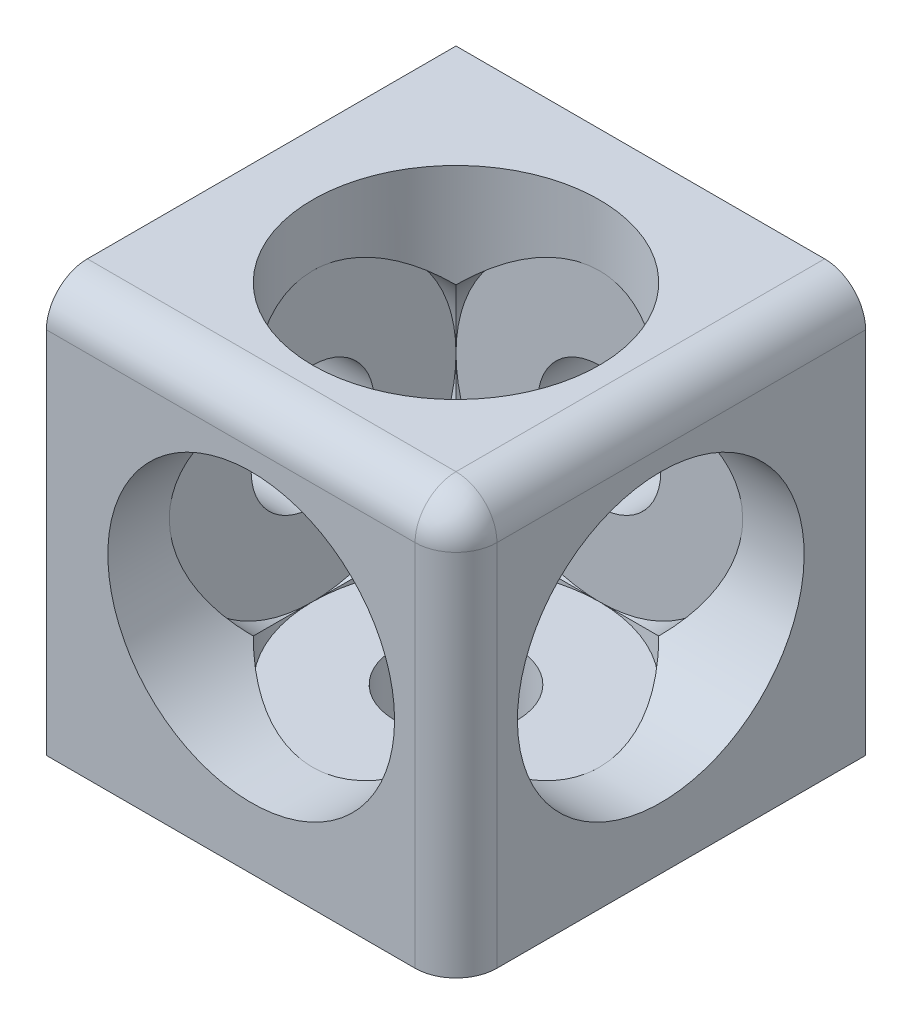
ISO-10303-21;
HEADER;
FILE_DESCRIPTION(('STEP AP214'),'2;1');
FILE_NAME('part.step','',(''),(''),'','','');
FILE_SCHEMA(('AUTOMOTIVE_DESIGN { 1 0 10303 214 1 1 1 1 }'));
ENDSEC;
DATA;
#1=APPLICATION_CONTEXT('core data for automotive mechanical design processes');
#2=APPLICATION_PROTOCOL_DEFINITION('international standard','automotive_design',2000,#1);
#3=PRODUCT_CONTEXT('',#1,'mechanical');
#4=PRODUCT('Part','Part','',(#3));
#5=PRODUCT_RELATED_PRODUCT_CATEGORY('part','',(#4));
#6=PRODUCT_DEFINITION_FORMATION('','',#4);
#7=PRODUCT_DEFINITION_CONTEXT('part definition',#1,'design');
#8=PRODUCT_DEFINITION('design','',#6,#7);
#9=PRODUCT_DEFINITION_SHAPE('','',#8);
#10=(LENGTH_UNIT() NAMED_UNIT(*) SI_UNIT(.MILLI.,.METRE.));
#11=(NAMED_UNIT(*) PLANE_ANGLE_UNIT() SI_UNIT($,.RADIAN.));
#12=(NAMED_UNIT(*) SI_UNIT($,.STERADIAN.) SOLID_ANGLE_UNIT());
#13=UNCERTAINTY_MEASURE_WITH_UNIT(LENGTH_MEASURE(1.E-05),#10,'distance_accuracy_value','');
#14=(GEOMETRIC_REPRESENTATION_CONTEXT(3) GLOBAL_UNCERTAINTY_ASSIGNED_CONTEXT((#13)) GLOBAL_UNIT_ASSIGNED_CONTEXT((#10,
#11,#12)) REPRESENTATION_CONTEXT('',''));
#15=CARTESIAN_POINT('',(0.,0.,0.));
#16=DIRECTION('',(0.,0.,1.));
#17=DIRECTION('',(1.,0.,0.));
#18=AXIS2_PLACEMENT_3D('',#15,#16,#17);
#19=CARTESIAN_POINT('',(-10.,10.,3.));
#20=DIRECTION('',(0.,0.,1.));
#21=DIRECTION('',(1.,0.,0.));
#22=AXIS2_PLACEMENT_3D('',#19,#20,#21);
#23=CYLINDRICAL_SURFACE('',#22,7.);
#24=CARTESIAN_POINT('',(-10.,10.,3.));
#25=DIRECTION('',(0.,0.,1.));
#26=DIRECTION('',(1.,0.,0.));
#27=AXIS2_PLACEMENT_3D('',#24,#25,#26);
#28=CIRCLE('',#27,7.);
#29=CARTESIAN_POINT('',(-10.,3.,3.));
#30=VERTEX_POINT('',#29);
#31=CARTESIAN_POINT('',(-3.,10.,3.));
#32=VERTEX_POINT('',#31);
#33=EDGE_CURVE('E202',#30,#32,#28,.T.);
#34=ORIENTED_EDGE('',*,*,#33,.F.);
#35=CARTESIAN_POINT('',(-10.,10.,10.));
#36=DIRECTION('',(0.,-0.707106781186547,0.707106781186547));
#37=DIRECTION('',(0.,0.707106781186547,0.707106781186547));
#38=AXIS2_PLACEMENT_3D('',#35,#36,#37);
#39=ELLIPSE('',#38,9.89949493661167,7.);
#40=CARTESIAN_POINT('',(-5.05025253169417,5.05025253169417,5.05025253169417));
#41=VERTEX_POINT('',#40);
#42=EDGE_CURVE('E193',#30,#41,#39,.T.);
#43=ORIENTED_EDGE('',*,*,#42,.T.);
#44=CARTESIAN_POINT('',(-10.,10.,10.));
#45=DIRECTION('',(0.707106781186547,0.,0.707106781186547));
#46=DIRECTION('',(-0.707106781186547,0.,0.707106781186547));
#47=AXIS2_PLACEMENT_3D('',#44,#45,#46);
#48=ELLIPSE('',#47,9.89949493661167,7.);
#49=EDGE_CURVE('E42',#41,#32,#48,.T.);
#50=ORIENTED_EDGE('',*,*,#49,.T.);
#51=EDGE_LOOP('',(#34,#43,#50));
#52=FACE_BOUND('',#51,.T.);
#53=ADVANCED_FACE('F33',(#52),#23,.F.);
#54=CARTESIAN_POINT('',(-5.05025253169417,14.9497474683058,5.05025253169417));
#55=VERTEX_POINT('',#54);
#56=EDGE_CURVE('E37',#32,#55,#48,.T.);
#57=ORIENTED_EDGE('',*,*,#56,.T.);
#58=CARTESIAN_POINT('',(-10.,10.,10.));
#59=DIRECTION('',(0.,0.707106781186547,0.707106781186547));
#60=DIRECTION('',(0.,-0.707106781186547,0.707106781186547));
#61=AXIS2_PLACEMENT_3D('',#58,#59,#60);
#62=ELLIPSE('',#61,9.89949493661167,7.);
#63=CARTESIAN_POINT('',(-10.,17.,3.));
#64=VERTEX_POINT('',#63);
#65=EDGE_CURVE('E294',#55,#64,#62,.T.);
#66=ORIENTED_EDGE('',*,*,#65,.T.);
#67=EDGE_CURVE('E197',#32,#64,#28,.T.);
#68=ORIENTED_EDGE('',*,*,#67,.F.);
#69=EDGE_LOOP('',(#57,#66,#68));
#70=FACE_BOUND('',#69,.T.);
#71=ADVANCED_FACE('F293',(#70),#23,.F.);
#72=CARTESIAN_POINT('',(-10.,0.,10.));
#73=DIRECTION('',(0.,1.,0.));
#74=DIRECTION('',(0.,0.,1.));
#75=AXIS2_PLACEMENT_3D('',#72,#73,#74);
#76=CYLINDRICAL_SURFACE('',#75,3.);
#77=CARTESIAN_POINT('',(-10.,0.,10.));
#78=DIRECTION('',(0.,1.,0.));
#79=DIRECTION('',(0.,0.,1.));
#80=AXIS2_PLACEMENT_3D('',#77,#78,#79);
#81=CIRCLE('',#80,3.);
#82=CARTESIAN_POINT('',(-10.,0.,13.));
#83=VERTEX_POINT('',#82);
#84=EDGE_CURVE('E206',#83,#83,#81,.T.);
#85=ORIENTED_EDGE('',*,*,#84,.F.);
#86=EDGE_LOOP('',(#85));
#87=FACE_BOUND('',#86,.T.);
#88=CARTESIAN_POINT('',(-10.,3.,10.));
#89=DIRECTION('',(0.,1.,0.));
#90=DIRECTION('',(0.,0.,1.));
#91=AXIS2_PLACEMENT_3D('',#88,#89,#90);
#92=CIRCLE('',#91,3.);
#93=CARTESIAN_POINT('',(-10.,3.,13.));
#94=VERTEX_POINT('',#93);
#95=EDGE_CURVE('E171',#94,#94,#92,.F.);
#96=ORIENTED_EDGE('',*,*,#95,.F.);
#97=EDGE_LOOP('',(#96));
#98=FACE_BOUND('',#97,.T.);
#99=ADVANCED_FACE('F343',(#87,#98),#76,.F.);
#100=CARTESIAN_POINT('',(-17.,10.,10.));
#101=DIRECTION('',(1.,0.,0.));
#102=DIRECTION('',(0.,1.,0.));
#103=AXIS2_PLACEMENT_3D('',#100,#101,#102);
#104=CYLINDRICAL_SURFACE('',#103,7.);
#105=CARTESIAN_POINT('',(-17.,10.,10.));
#106=DIRECTION('',(1.,0.,0.));
#107=DIRECTION('',(0.,1.,0.));
#108=AXIS2_PLACEMENT_3D('',#105,#106,#107);
#109=CIRCLE('',#108,7.);
#110=CARTESIAN_POINT('',(-17.,3.,10.));
#111=VERTEX_POINT('',#110);
#112=CARTESIAN_POINT('',(-17.,10.,3.));
#113=VERTEX_POINT('',#112);
#114=EDGE_CURVE('E187',#111,#113,#109,.T.);
#115=ORIENTED_EDGE('',*,*,#114,.F.);
#116=CARTESIAN_POINT('',(-10.,10.,10.));
#117=DIRECTION('',(0.707106781186547,-0.707106781186547,0.));
#118=DIRECTION('',(0.707106781186547,0.707106781186547,0.));
#119=AXIS2_PLACEMENT_3D('',#116,#117,#118);
#120=ELLIPSE('',#119,9.89949493661167,7.);
#121=CARTESIAN_POINT('',(-14.9497474683058,5.05025253169417,5.05025253169417));
#122=VERTEX_POINT('',#121);
#123=EDGE_CURVE('E302',#111,#122,#120,.T.);
#124=ORIENTED_EDGE('',*,*,#123,.T.);
#125=CARTESIAN_POINT('',(-10.,10.,10.));
#126=DIRECTION('',(-0.707106781186547,0.,0.707106781186547));
#127=DIRECTION('',(0.707106781186547,0.,0.707106781186547));
#128=AXIS2_PLACEMENT_3D('',#125,#126,#127);
#129=ELLIPSE('',#128,9.89949493661167,7.);
#130=EDGE_CURVE('E260',#113,#122,#129,.T.);
#131=ORIENTED_EDGE('',*,*,#130,.F.);
#132=EDGE_LOOP('',(#115,#124,#131));
#133=FACE_BOUND('',#132,.T.);
#134=ADVANCED_FACE('F321',(#133),#104,.F.);
#135=CARTESIAN_POINT('',(-14.9497474683058,14.9497474683058,5.05025253169417));
#136=VERTEX_POINT('',#135);
#137=EDGE_CURVE('E270',#136,#113,#129,.T.);
#138=ORIENTED_EDGE('',*,*,#137,.F.);
#139=CARTESIAN_POINT('',(-10.,10.,10.));
#140=DIRECTION('',(0.707106781186547,0.707106781186547,0.));
#141=DIRECTION('',(0.707106781186547,-0.707106781186547,0.));
#142=AXIS2_PLACEMENT_3D('',#139,#140,#141);
#143=ELLIPSE('',#142,9.89949493661167,7.);
#144=CARTESIAN_POINT('',(-17.,17.,10.));
#145=VERTEX_POINT('',#144);
#146=EDGE_CURVE('E301',#136,#145,#143,.T.);
#147=ORIENTED_EDGE('',*,*,#146,.T.);
#148=EDGE_CURVE('E188',#113,#145,#109,.T.);
#149=ORIENTED_EDGE('',*,*,#148,.F.);
#150=EDGE_LOOP('',(#138,#147,#149));
#151=FACE_BOUND('',#150,.T.);
#152=ADVANCED_FACE('F333',(#151),#104,.F.);
#153=CARTESIAN_POINT('',(-20.,10.,10.));
#154=DIRECTION('',(1.,0.,0.));
#155=DIRECTION('',(0.,1.,0.));
#156=AXIS2_PLACEMENT_3D('',#153,#154,#155);
#157=CYLINDRICAL_SURFACE('',#156,3.);
#158=CARTESIAN_POINT('',(-20.,10.,10.));
#159=DIRECTION('',(1.,0.,0.));
#160=DIRECTION('',(0.,1.,0.));
#161=AXIS2_PLACEMENT_3D('',#158,#159,#160);
#162=CIRCLE('',#161,3.);
#163=CARTESIAN_POINT('',(-20.,13.,10.));
#164=VERTEX_POINT('',#163);
#165=EDGE_CURVE('E209',#164,#164,#162,.T.);
#166=ORIENTED_EDGE('',*,*,#165,.F.);
#167=EDGE_LOOP('',(#166));
#168=FACE_BOUND('',#167,.T.);
#169=CARTESIAN_POINT('',(-17.,10.,10.));
#170=DIRECTION('',(1.,0.,0.));
#171=DIRECTION('',(0.,1.,0.));
#172=AXIS2_PLACEMENT_3D('',#169,#170,#171);
#173=CIRCLE('',#172,3.);
#174=CARTESIAN_POINT('',(-17.,13.,10.));
#175=VERTEX_POINT('',#174);
#176=EDGE_CURVE('E186',#175,#175,#173,.F.);
#177=ORIENTED_EDGE('',*,*,#176,.F.);
#178=EDGE_LOOP('',(#177));
#179=FACE_BOUND('',#178,.T.);
#180=ADVANCED_FACE('F335',(#168,#179),#157,.F.);
#181=ORIENTED_EDGE('',*,*,#130,.T.);
#182=EDGE_CURVE('E51',#122,#30,#39,.T.);
#183=ORIENTED_EDGE('',*,*,#182,.T.);
#184=EDGE_CURVE('E203',#113,#30,#28,.T.);
#185=ORIENTED_EDGE('',*,*,#184,.F.);
#186=EDGE_LOOP('',(#181,#183,#185));
#187=FACE_BOUND('',#186,.T.);
#188=ADVANCED_FACE('F299',(#187),#23,.F.);
#189=EDGE_CURVE('E201',#64,#113,#28,.T.);
#190=ORIENTED_EDGE('',*,*,#189,.F.);
#191=EDGE_CURVE('E304',#64,#136,#62,.T.);
#192=ORIENTED_EDGE('',*,*,#191,.T.);
#193=ORIENTED_EDGE('',*,*,#137,.T.);
#194=EDGE_LOOP('',(#190,#192,#193));
#195=FACE_BOUND('',#194,.T.);
#196=ADVANCED_FACE('F354',(#195),#23,.F.);
#197=CARTESIAN_POINT('',(-10.,10.,0.));
#198=DIRECTION('',(0.,0.,1.));
#199=DIRECTION('',(1.,0.,0.));
#200=AXIS2_PLACEMENT_3D('',#197,#198,#199);
#201=CYLINDRICAL_SURFACE('',#200,3.);
#202=CARTESIAN_POINT('',(-10.,10.,0.));
#203=DIRECTION('',(0.,0.,1.));
#204=DIRECTION('',(1.,0.,0.));
#205=AXIS2_PLACEMENT_3D('',#202,#203,#204);
#206=CIRCLE('',#205,3.);
#207=CARTESIAN_POINT('',(-7.,10.,0.));
#208=VERTEX_POINT('',#207);
#209=EDGE_CURVE('E212',#208,#208,#206,.T.);
#210=ORIENTED_EDGE('',*,*,#209,.F.);
#211=EDGE_LOOP('',(#210));
#212=FACE_BOUND('',#211,.T.);
#213=CARTESIAN_POINT('',(-10.,10.,3.));
#214=DIRECTION('',(0.,0.,1.));
#215=DIRECTION('',(1.,0.,0.));
#216=AXIS2_PLACEMENT_3D('',#213,#214,#215);
#217=CIRCLE('',#216,3.);
#218=CARTESIAN_POINT('',(-7.,10.,3.));
#219=VERTEX_POINT('',#218);
#220=EDGE_CURVE('E200',#219,#219,#217,.F.);
#221=ORIENTED_EDGE('',*,*,#220,.F.);
#222=EDGE_LOOP('',(#221));
#223=FACE_BOUND('',#222,.T.);
#224=ADVANCED_FACE('F363',(#212,#223),#201,.F.);
#225=CARTESIAN_POINT('',(-20.,20.,20.));
#226=DIRECTION('',(1.,0.,0.));
#227=DIRECTION('',(0.,0.,-1.));
#228=AXIS2_PLACEMENT_3D('',#225,#226,#227);
#229=PLANE('',#228);
#230=ORIENTED_EDGE('',*,*,#165,.T.);
#231=EDGE_LOOP('',(#230));
#232=FACE_BOUND('',#231,.T.);
#233=DIRECTION('',(0.,-1.,0.));
#234=VECTOR('',#233,1.);
#235=CARTESIAN_POINT('',(-20.,20.,20.));
#236=LINE('',#235,#234);
#237=CARTESIAN_POINT('',(-20.,18.,20.));
#238=VERTEX_POINT('',#237);
#239=CARTESIAN_POINT('',(-20.,0.,20.));
#240=VERTEX_POINT('',#239);
#241=EDGE_CURVE('E216',#238,#240,#236,.T.);
#242=ORIENTED_EDGE('',*,*,#241,.F.);
#243=CARTESIAN_POINT('',(-20.,18.,18.));
#244=DIRECTION('',(1.,0.,0.));
#245=DIRECTION('',(0.,0.,-1.));
#246=AXIS2_PLACEMENT_3D('',#243,#244,#245);
#247=CIRCLE('',#246,2.);
#248=CARTESIAN_POINT('',(-20.,20.,18.));
#249=VERTEX_POINT('',#248);
#250=EDGE_CURVE('E252',#238,#249,#247,.F.);
#251=ORIENTED_EDGE('',*,*,#250,.T.);
#252=DIRECTION('',(0.,0.,-1.));
#253=VECTOR('',#252,1.);
#254=CARTESIAN_POINT('',(-20.,20.,20.));
#255=LINE('',#254,#253);
#256=CARTESIAN_POINT('',(-20.,20.,0.));
#257=VERTEX_POINT('',#256);
#258=EDGE_CURVE('E222',#249,#257,#255,.T.);
#259=ORIENTED_EDGE('',*,*,#258,.T.);
#260=DIRECTION('',(0.,-1.,0.));
#261=VECTOR('',#260,1.);
#262=CARTESIAN_POINT('',(-20.,20.,0.));
#263=LINE('',#262,#261);
#264=CARTESIAN_POINT('',(-20.,0.,0.));
#265=VERTEX_POINT('',#264);
#266=EDGE_CURVE('E223',#257,#265,#263,.T.);
#267=ORIENTED_EDGE('',*,*,#266,.T.);
#268=DIRECTION('',(0.,0.,-1.));
#269=VECTOR('',#268,1.);
#270=CARTESIAN_POINT('',(-20.,0.,20.));
#271=LINE('',#270,#269);
#272=EDGE_CURVE('E238',#240,#265,#271,.T.);
#273=ORIENTED_EDGE('',*,*,#272,.F.);
#274=EDGE_LOOP('',(#242,#251,#259,#267,#273));
#275=FACE_BOUND('',#274,.T.);
#276=ADVANCED_FACE('F368',(#232,#275),#229,.F.);
#277=CARTESIAN_POINT('',(-20.,0.,20.));
#278=DIRECTION('',(0.,1.,0.));
#279=DIRECTION('',(0.,0.,1.));
#280=AXIS2_PLACEMENT_3D('',#277,#278,#279);
#281=PLANE('',#280);
#282=ORIENTED_EDGE('',*,*,#84,.T.);
#283=EDGE_LOOP('',(#282));
#284=FACE_BOUND('',#283,.T.);
#285=DIRECTION('',(0.,0.,-1.));
#286=VECTOR('',#285,1.);
#287=CARTESIAN_POINT('',(0.,0.,20.));
#288=LINE('',#287,#286);
#289=CARTESIAN_POINT('',(0.,0.,18.));
#290=VERTEX_POINT('',#289);
#291=CARTESIAN_POINT('',(0.,0.,0.));
#292=VERTEX_POINT('',#291);
#293=EDGE_CURVE('E236',#290,#292,#288,.T.);
#294=ORIENTED_EDGE('',*,*,#293,.F.);
#295=CARTESIAN_POINT('',(-2.,0.,18.));
#296=DIRECTION('',(0.,1.,0.));
#297=DIRECTION('',(0.,0.,1.));
#298=AXIS2_PLACEMENT_3D('',#295,#296,#297);
#299=CIRCLE('',#298,2.);
#300=CARTESIAN_POINT('',(-2.,0.,20.));
#301=VERTEX_POINT('',#300);
#302=EDGE_CURVE('E250',#290,#301,#299,.F.);
#303=ORIENTED_EDGE('',*,*,#302,.T.);
#304=DIRECTION('',(1.,0.,0.));
#305=VECTOR('',#304,1.);
#306=CARTESIAN_POINT('',(-20.,0.,20.));
#307=LINE('',#306,#305);
#308=EDGE_CURVE('E218',#240,#301,#307,.T.);
#309=ORIENTED_EDGE('',*,*,#308,.F.);
#310=ORIENTED_EDGE('',*,*,#272,.T.);
#311=DIRECTION('',(1.,0.,0.));
#312=VECTOR('',#311,1.);
#313=CARTESIAN_POINT('',(-20.,0.,0.));
#314=LINE('',#313,#312);
#315=EDGE_CURVE('E226',#265,#292,#314,.T.);
#316=ORIENTED_EDGE('',*,*,#315,.T.);
#317=EDGE_LOOP('',(#294,#303,#309,#310,#316));
#318=FACE_BOUND('',#317,.T.);
#319=ADVANCED_FACE('F419',(#284,#318),#281,.F.);
#320=CARTESIAN_POINT('',(0.,20.,20.));
#321=DIRECTION('',(-1.,0.,0.));
#322=DIRECTION('',(0.,-1.,0.));
#323=AXIS2_PLACEMENT_3D('',#320,#321,#322);
#324=PLANE('',#323);
#325=CARTESIAN_POINT('',(0.,10.,10.));
#326=DIRECTION('',(1.,0.,0.));
#327=DIRECTION('',(0.,1.,0.));
#328=AXIS2_PLACEMENT_3D('',#325,#326,#327);
#329=CIRCLE('',#328,7.);
#330=CARTESIAN_POINT('',(0.,17.,10.));
#331=VERTEX_POINT('',#330);
#332=EDGE_CURVE('E189',#331,#331,#329,.T.);
#333=ORIENTED_EDGE('',*,*,#332,.F.);
#334=EDGE_LOOP('',(#333));
#335=FACE_BOUND('',#334,.T.);
#336=DIRECTION('',(0.,0.,-1.));
#337=VECTOR('',#336,1.);
#338=CARTESIAN_POINT('',(0.,18.,20.));
#339=LINE('',#338,#337);
#340=CARTESIAN_POINT('',(0.,18.,0.));
#341=VERTEX_POINT('',#340);
#342=CARTESIAN_POINT('',(0.,18.,18.));
#343=VERTEX_POINT('',#342);
#344=EDGE_CURVE('E246',#341,#343,#339,.F.);
#345=ORIENTED_EDGE('',*,*,#344,.T.);
#346=DIRECTION('',(0.,1.,0.));
#347=VECTOR('',#346,1.);
#348=CARTESIAN_POINT('',(0.,0.,18.));
#349=LINE('',#348,#347);
#350=EDGE_CURVE('E248',#343,#290,#349,.F.);
#351=ORIENTED_EDGE('',*,*,#350,.T.);
#352=ORIENTED_EDGE('',*,*,#293,.T.);
#353=DIRECTION('',(0.,1.,0.));
#354=VECTOR('',#353,1.);
#355=CARTESIAN_POINT('',(0.,20.,0.));
#356=LINE('',#355,#354);
#357=EDGE_CURVE('E230',#292,#341,#356,.T.);
#358=ORIENTED_EDGE('',*,*,#357,.T.);
#359=EDGE_LOOP('',(#345,#351,#352,#358));
#360=FACE_BOUND('',#359,.T.);
#361=ADVANCED_FACE('F413',(#335,#360),#324,.F.);
#362=CARTESIAN_POINT('',(-20.,20.,20.));
#363=DIRECTION('',(0.,-1.,0.));
#364=DIRECTION('',(0.,0.,-1.));
#365=AXIS2_PLACEMENT_3D('',#362,#363,#364);
#366=PLANE('',#365);
#367=CARTESIAN_POINT('',(-10.,20.,10.));
#368=DIRECTION('',(0.,1.,0.));
#369=DIRECTION('',(0.,0.,1.));
#370=AXIS2_PLACEMENT_3D('',#367,#368,#369);
#371=CIRCLE('',#370,7.);
#372=CARTESIAN_POINT('',(-10.,20.,17.));
#373=VERTEX_POINT('',#372);
#374=EDGE_CURVE('E164',#373,#373,#371,.T.);
#375=ORIENTED_EDGE('',*,*,#374,.F.);
#376=EDGE_LOOP('',(#375));
#377=FACE_BOUND('',#376,.T.);
#378=ORIENTED_EDGE('',*,*,#258,.F.);
#379=DIRECTION('',(-1.,0.,0.));
#380=VECTOR('',#379,1.);
#381=CARTESIAN_POINT('',(0.,20.,18.));
#382=LINE('',#381,#380);
#383=CARTESIAN_POINT('',(-2.,20.,18.));
#384=VERTEX_POINT('',#383);
#385=EDGE_CURVE('E256',#249,#384,#382,.F.);
#386=ORIENTED_EDGE('',*,*,#385,.T.);
#387=DIRECTION('',(0.,0.,-1.));
#388=VECTOR('',#387,1.);
#389=CARTESIAN_POINT('',(-2.,20.,20.));
#390=LINE('',#389,#388);
#391=CARTESIAN_POINT('',(-2.,20.,0.));
#392=VERTEX_POINT('',#391);
#393=EDGE_CURVE('E254',#384,#392,#390,.T.);
#394=ORIENTED_EDGE('',*,*,#393,.T.);
#395=DIRECTION('',(-1.,0.,0.));
#396=VECTOR('',#395,1.);
#397=CARTESIAN_POINT('',(-20.,20.,0.));
#398=LINE('',#397,#396);
#399=EDGE_CURVE('E219',#392,#257,#398,.T.);
#400=ORIENTED_EDGE('',*,*,#399,.T.);
#401=EDGE_LOOP('',(#378,#386,#394,#400));
#402=FACE_BOUND('',#401,.T.);
#403=ADVANCED_FACE('F418',(#377,#402),#366,.F.);
#404=CARTESIAN_POINT('',(0.,0.,20.));
#405=DIRECTION('',(0.,0.,1.));
#406=DIRECTION('',(1.,0.,0.));
#407=AXIS2_PLACEMENT_3D('',#404,#405,#406);
#408=PLANE('',#407);
#409=CARTESIAN_POINT('',(-10.,10.,20.));
#410=DIRECTION('',(0.,0.,1.));
#411=DIRECTION('',(1.,0.,0.));
#412=AXIS2_PLACEMENT_3D('',#409,#410,#411);
#413=CIRCLE('',#412,7.);
#414=CARTESIAN_POINT('',(-3.,10.,20.));
#415=VERTEX_POINT('',#414);
#416=EDGE_CURVE('E196',#415,#415,#413,.T.);
#417=ORIENTED_EDGE('',*,*,#416,.F.);
#418=EDGE_LOOP('',(#417));
#419=FACE_BOUND('',#418,.T.);
#420=ORIENTED_EDGE('',*,*,#308,.T.);
#421=DIRECTION('',(0.,1.,0.));
#422=VECTOR('',#421,1.);
#423=CARTESIAN_POINT('',(-2.,20.,20.));
#424=LINE('',#423,#422);
#425=CARTESIAN_POINT('',(-2.,18.,20.));
#426=VERTEX_POINT('',#425);
#427=EDGE_CURVE('E243',#301,#426,#424,.T.);
#428=ORIENTED_EDGE('',*,*,#427,.T.);
#429=DIRECTION('',(-1.,0.,0.));
#430=VECTOR('',#429,1.);
#431=CARTESIAN_POINT('',(-20.,18.,20.));
#432=LINE('',#431,#430);
#433=EDGE_CURVE('E241',#426,#238,#432,.T.);
#434=ORIENTED_EDGE('',*,*,#433,.T.);
#435=ORIENTED_EDGE('',*,*,#241,.T.);
#436=EDGE_LOOP('',(#420,#428,#434,#435));
#437=FACE_BOUND('',#436,.T.);
#438=ADVANCED_FACE('F429',(#419,#437),#408,.T.);
#439=CARTESIAN_POINT('',(0.,0.,0.));
#440=DIRECTION('',(0.,0.,1.));
#441=DIRECTION('',(1.,0.,0.));
#442=AXIS2_PLACEMENT_3D('',#439,#440,#441);
#443=PLANE('',#442);
#444=ORIENTED_EDGE('',*,*,#209,.T.);
#445=EDGE_LOOP('',(#444));
#446=FACE_BOUND('',#445,.T.);
#447=ORIENTED_EDGE('',*,*,#399,.F.);
#448=CARTESIAN_POINT('',(-2.,18.,0.));
#449=DIRECTION('',(0.,0.,1.));
#450=DIRECTION('',(1.,0.,0.));
#451=AXIS2_PLACEMENT_3D('',#448,#449,#450);
#452=CIRCLE('',#451,2.);
#453=EDGE_CURVE('E258',#392,#341,#452,.F.);
#454=ORIENTED_EDGE('',*,*,#453,.T.);
#455=ORIENTED_EDGE('',*,*,#357,.F.);
#456=ORIENTED_EDGE('',*,*,#315,.F.);
#457=ORIENTED_EDGE('',*,*,#266,.F.);
#458=EDGE_LOOP('',(#447,#454,#455,#456,#457));
#459=FACE_BOUND('',#458,.T.);
#460=ADVANCED_FACE('F434',(#446,#459),#443,.F.);
#461=CARTESIAN_POINT('',(0.,18.,18.));
#462=DIRECTION('',(1.,0.,0.));
#463=DIRECTION('',(0.,0.,-1.));
#464=AXIS2_PLACEMENT_3D('',#461,#462,#463);
#465=CYLINDRICAL_SURFACE('',#464,2.);
#466=ORIENTED_EDGE('',*,*,#250,.F.);
#467=ORIENTED_EDGE('',*,*,#433,.F.);
#468=CARTESIAN_POINT('',(-2.,18.,18.));
#469=DIRECTION('',(1.,0.,0.));
#470=DIRECTION('',(0.,0.,-1.));
#471=AXIS2_PLACEMENT_3D('',#468,#469,#470);
#472=CIRCLE('',#471,2.);
#473=EDGE_CURVE('E227',#384,#426,#472,.T.);
#474=ORIENTED_EDGE('',*,*,#473,.F.);
#475=ORIENTED_EDGE('',*,*,#385,.F.);
#476=EDGE_LOOP('',(#466,#467,#474,#475));
#477=FACE_BOUND('',#476,.T.);
#478=ADVANCED_FACE('F35',(#477),#465,.T.);
#479=CARTESIAN_POINT('',(-2.,18.,20.));
#480=DIRECTION('',(0.,0.,-1.));
#481=DIRECTION('',(-1.,0.,0.));
#482=AXIS2_PLACEMENT_3D('',#479,#480,#481);
#483=CYLINDRICAL_SURFACE('',#482,2.);
#484=ORIENTED_EDGE('',*,*,#453,.F.);
#485=ORIENTED_EDGE('',*,*,#393,.F.);
#486=CARTESIAN_POINT('',(-2.,18.,18.));
#487=DIRECTION('',(0.,0.,1.));
#488=DIRECTION('',(1.,0.,0.));
#489=AXIS2_PLACEMENT_3D('',#486,#487,#488);
#490=CIRCLE('',#489,2.);
#491=EDGE_CURVE('E262',#343,#384,#490,.T.);
#492=ORIENTED_EDGE('',*,*,#491,.F.);
#493=ORIENTED_EDGE('',*,*,#344,.F.);
#494=EDGE_LOOP('',(#484,#485,#492,#493));
#495=FACE_BOUND('',#494,.T.);
#496=ADVANCED_FACE('F482',(#495),#483,.T.);
#497=CARTESIAN_POINT('',(-2.,18.,18.));
#498=DIRECTION('',(0.,0.,1.));
#499=DIRECTION('',(1.,0.,0.));
#500=AXIS2_PLACEMENT_3D('',#497,#498,#499);
#501=SPHERICAL_SURFACE('',#500,2.);
#502=ORIENTED_EDGE('',*,*,#491,.T.);
#503=ORIENTED_EDGE('',*,*,#473,.T.);
#504=CARTESIAN_POINT('',(-2.,18.,18.));
#505=DIRECTION('',(0.,1.,0.));
#506=DIRECTION('',(0.,0.,1.));
#507=AXIS2_PLACEMENT_3D('',#504,#505,#506);
#508=CIRCLE('',#507,2.);
#509=EDGE_CURVE('E215',#343,#426,#508,.F.);
#510=ORIENTED_EDGE('',*,*,#509,.F.);
#511=EDGE_LOOP('',(#502,#503,#510));
#512=FACE_BOUND('',#511,.T.);
#513=ADVANCED_FACE('F471',(#512),#501,.T.);
#514=CARTESIAN_POINT('',(-2.,0.,18.));
#515=DIRECTION('',(0.,-1.,0.));
#516=DIRECTION('',(1.,0.,0.));
#517=AXIS2_PLACEMENT_3D('',#514,#515,#516);
#518=CYLINDRICAL_SURFACE('',#517,2.);
#519=ORIENTED_EDGE('',*,*,#302,.F.);
#520=ORIENTED_EDGE('',*,*,#350,.F.);
#521=ORIENTED_EDGE('',*,*,#509,.T.);
#522=ORIENTED_EDGE('',*,*,#427,.F.);
#523=EDGE_LOOP('',(#519,#520,#521,#522));
#524=FACE_BOUND('',#523,.T.);
#525=ADVANCED_FACE('F360',(#524),#518,.T.);
#526=CARTESIAN_POINT('',(-10.,10.,3.));
#527=DIRECTION('',(0.,0.,1.));
#528=DIRECTION('',(1.,0.,0.));
#529=AXIS2_PLACEMENT_3D('',#526,#527,#528);
#530=PLANE('',#529);
#531=ORIENTED_EDGE('',*,*,#220,.T.);
#532=EDGE_LOOP('',(#531));
#533=FACE_BOUND('',#532,.T.);
#534=ORIENTED_EDGE('',*,*,#184,.T.);
#535=ORIENTED_EDGE('',*,*,#33,.T.);
#536=ORIENTED_EDGE('',*,*,#67,.T.);
#537=ORIENTED_EDGE('',*,*,#189,.T.);
#538=EDGE_LOOP('',(#534,#535,#536,#537));
#539=FACE_BOUND('',#538,.T.);
#540=ADVANCED_FACE('F296',(#533,#539),#530,.T.);
#541=CARTESIAN_POINT('',(-10.,10.,10.));
#542=DIRECTION('',(-0.707106781186547,0.,0.707106781186547));
#543=DIRECTION('',(0.707106781186547,0.,0.707106781186547));
#544=AXIS2_PLACEMENT_3D('',#541,#542,#543);
#545=ELLIPSE('',#544,9.89949493661167,7.);
#546=CARTESIAN_POINT('',(-5.05025253169417,14.9497474683058,14.9497474683058));
#547=VERTEX_POINT('',#546);
#548=CARTESIAN_POINT('',(-5.05025253169417,5.05025253169417,14.9497474683058));
#549=VERTEX_POINT('',#548);
#550=EDGE_CURVE('E177',#547,#549,#545,.F.);
#551=ORIENTED_EDGE('',*,*,#550,.T.);
#552=CARTESIAN_POINT('',(-10.,10.,10.));
#553=DIRECTION('',(0.,0.707106781186547,0.707106781186547));
#554=DIRECTION('',(0.,-0.707106781186547,0.707106781186547));
#555=AXIS2_PLACEMENT_3D('',#552,#553,#554);
#556=ELLIPSE('',#555,9.89949493661167,7.);
#557=CARTESIAN_POINT('',(-10.,3.,17.));
#558=VERTEX_POINT('',#557);
#559=EDGE_CURVE('E153',#549,#558,#556,.F.);
#560=ORIENTED_EDGE('',*,*,#559,.T.);
#561=CARTESIAN_POINT('',(-14.9497474683058,5.05025253169417,14.9497474683058));
#562=VERTEX_POINT('',#561);
#563=EDGE_CURVE('E143',#558,#562,#556,.F.);
#564=ORIENTED_EDGE('',*,*,#563,.T.);
#565=CARTESIAN_POINT('',(-10.,10.,10.));
#566=DIRECTION('',(0.707106781186547,0.,0.707106781186547));
#567=DIRECTION('',(-0.707106781186547,0.,0.707106781186547));
#568=AXIS2_PLACEMENT_3D('',#565,#566,#567);
#569=ELLIPSE('',#568,9.89949493661167,7.);
#570=CARTESIAN_POINT('',(-17.,10.,17.));
#571=VERTEX_POINT('',#570);
#572=EDGE_CURVE('E11',#562,#571,#569,.F.);
#573=ORIENTED_EDGE('',*,*,#572,.T.);
#574=CARTESIAN_POINT('',(-14.9497474683058,14.9497474683058,14.9497474683058));
#575=VERTEX_POINT('',#574);
#576=EDGE_CURVE('E44',#571,#575,#569,.F.);
#577=ORIENTED_EDGE('',*,*,#576,.T.);
#578=CARTESIAN_POINT('',(-10.,10.,10.));
#579=DIRECTION('',(0.,-0.707106781186547,0.707106781186547));
#580=DIRECTION('',(0.,0.707106781186547,0.707106781186547));
#581=AXIS2_PLACEMENT_3D('',#578,#579,#580);
#582=ELLIPSE('',#581,9.89949493661167,7.);
#583=EDGE_CURVE('E59',#575,#547,#582,.F.);
#584=ORIENTED_EDGE('',*,*,#583,.T.);
#585=EDGE_LOOP('',(#551,#560,#564,#573,#577,#584));
#586=FACE_BOUND('',#585,.T.);
#587=ORIENTED_EDGE('',*,*,#416,.T.);
#588=EDGE_LOOP('',(#587));
#589=FACE_BOUND('',#588,.T.);
#590=ADVANCED_FACE('F174',(#586,#589),#23,.F.);
#591=ORIENTED_EDGE('',*,*,#332,.T.);
#592=EDGE_LOOP('',(#591));
#593=FACE_BOUND('',#592,.T.);
#594=ORIENTED_EDGE('',*,*,#49,.F.);
#595=CARTESIAN_POINT('',(-10.,10.,10.));
#596=DIRECTION('',(0.707106781186547,0.707106781186547,0.));
#597=DIRECTION('',(0.707106781186547,-0.707106781186547,0.));
#598=AXIS2_PLACEMENT_3D('',#595,#596,#597);
#599=ELLIPSE('',#598,9.89949493661167,7.);
#600=CARTESIAN_POINT('',(-3.,3.,10.));
#601=VERTEX_POINT('',#600);
#602=EDGE_CURVE('E178',#41,#601,#599,.F.);
#603=ORIENTED_EDGE('',*,*,#602,.T.);
#604=EDGE_CURVE('E169',#601,#549,#599,.F.);
#605=ORIENTED_EDGE('',*,*,#604,.T.);
#606=ORIENTED_EDGE('',*,*,#550,.F.);
#607=CARTESIAN_POINT('',(-10.,10.,10.));
#608=DIRECTION('',(0.707106781186547,-0.707106781186547,0.));
#609=DIRECTION('',(0.707106781186547,0.707106781186547,0.));
#610=AXIS2_PLACEMENT_3D('',#607,#608,#609);
#611=ELLIPSE('',#610,9.89949493661167,7.);
#612=EDGE_CURVE('E292',#547,#55,#611,.F.);
#613=ORIENTED_EDGE('',*,*,#612,.T.);
#614=ORIENTED_EDGE('',*,*,#56,.F.);
#615=EDGE_LOOP('',(#594,#603,#605,#606,#613,#614));
#616=FACE_BOUND('',#615,.T.);
#617=ADVANCED_FACE('F291',(#593,#616),#104,.F.);
#618=ORIENTED_EDGE('',*,*,#572,.F.);
#619=EDGE_CURVE('E149',#562,#111,#120,.T.);
#620=ORIENTED_EDGE('',*,*,#619,.T.);
#621=EDGE_CURVE('E183',#571,#111,#109,.T.);
#622=ORIENTED_EDGE('',*,*,#621,.F.);
#623=EDGE_LOOP('',(#618,#620,#622));
#624=FACE_BOUND('',#623,.T.);
#625=ADVANCED_FACE('F319',(#624),#104,.F.);
#626=EDGE_CURVE('E192',#145,#571,#109,.T.);
#627=ORIENTED_EDGE('',*,*,#626,.F.);
#628=EDGE_CURVE('E306',#145,#575,#143,.T.);
#629=ORIENTED_EDGE('',*,*,#628,.T.);
#630=ORIENTED_EDGE('',*,*,#576,.F.);
#631=EDGE_LOOP('',(#627,#629,#630));
#632=FACE_BOUND('',#631,.T.);
#633=ADVANCED_FACE('F330',(#632),#104,.F.);
#634=CARTESIAN_POINT('',(-17.,10.,10.));
#635=DIRECTION('',(1.,0.,0.));
#636=DIRECTION('',(0.,1.,0.));
#637=AXIS2_PLACEMENT_3D('',#634,#635,#636);
#638=PLANE('',#637);
#639=ORIENTED_EDGE('',*,*,#176,.T.);
#640=EDGE_LOOP('',(#639));
#641=FACE_BOUND('',#640,.T.);
#642=ORIENTED_EDGE('',*,*,#621,.T.);
#643=ORIENTED_EDGE('',*,*,#114,.T.);
#644=ORIENTED_EDGE('',*,*,#148,.T.);
#645=ORIENTED_EDGE('',*,*,#626,.T.);
#646=EDGE_LOOP('',(#642,#643,#644,#645));
#647=FACE_BOUND('',#646,.T.);
#648=ADVANCED_FACE('F326',(#641,#647),#638,.T.);
#649=CARTESIAN_POINT('',(-10.,3.,10.));
#650=DIRECTION('',(0.,1.,0.));
#651=DIRECTION('',(0.,0.,1.));
#652=AXIS2_PLACEMENT_3D('',#649,#650,#651);
#653=CYLINDRICAL_SURFACE('',#652,7.);
#654=ORIENTED_EDGE('',*,*,#374,.T.);
#655=EDGE_LOOP('',(#654));
#656=FACE_BOUND('',#655,.T.);
#657=ORIENTED_EDGE('',*,*,#65,.F.);
#658=ORIENTED_EDGE('',*,*,#612,.F.);
#659=ORIENTED_EDGE('',*,*,#583,.F.);
#660=ORIENTED_EDGE('',*,*,#628,.F.);
#661=ORIENTED_EDGE('',*,*,#146,.F.);
#662=ORIENTED_EDGE('',*,*,#191,.F.);
#663=EDGE_LOOP('',(#657,#658,#659,#660,#661,#662));
#664=FACE_BOUND('',#663,.T.);
#665=ADVANCED_FACE('F331',(#656,#664),#653,.F.);
#666=CARTESIAN_POINT('',(-10.,3.,10.));
#667=DIRECTION('',(0.,1.,0.));
#668=DIRECTION('',(0.,0.,1.));
#669=AXIS2_PLACEMENT_3D('',#666,#667,#668);
#670=CIRCLE('',#669,7.);
#671=EDGE_CURVE('E172',#601,#30,#670,.T.);
#672=ORIENTED_EDGE('',*,*,#671,.F.);
#673=ORIENTED_EDGE('',*,*,#602,.F.);
#674=ORIENTED_EDGE('',*,*,#42,.F.);
#675=EDGE_LOOP('',(#672,#673,#674));
#676=FACE_BOUND('',#675,.T.);
#677=ADVANCED_FACE('F308',(#676),#653,.F.);
#678=EDGE_CURVE('E161',#558,#601,#670,.T.);
#679=ORIENTED_EDGE('',*,*,#678,.F.);
#680=ORIENTED_EDGE('',*,*,#559,.F.);
#681=ORIENTED_EDGE('',*,*,#604,.F.);
#682=EDGE_LOOP('',(#679,#680,#681));
#683=FACE_BOUND('',#682,.T.);
#684=ADVANCED_FACE('F167',(#683),#653,.F.);
#685=EDGE_CURVE('E146',#111,#558,#670,.T.);
#686=ORIENTED_EDGE('',*,*,#685,.F.);
#687=ORIENTED_EDGE('',*,*,#619,.F.);
#688=ORIENTED_EDGE('',*,*,#563,.F.);
#689=EDGE_LOOP('',(#686,#687,#688));
#690=FACE_BOUND('',#689,.T.);
#691=ADVANCED_FACE('F145',(#690),#653,.F.);
#692=ORIENTED_EDGE('',*,*,#123,.F.);
#693=EDGE_CURVE('E163',#30,#111,#670,.T.);
#694=ORIENTED_EDGE('',*,*,#693,.F.);
#695=ORIENTED_EDGE('',*,*,#182,.F.);
#696=EDGE_LOOP('',(#692,#694,#695));
#697=FACE_BOUND('',#696,.T.);
#698=ADVANCED_FACE('F535',(#697),#653,.F.);
#699=CARTESIAN_POINT('',(-10.,3.,10.));
#700=DIRECTION('',(0.,1.,0.));
#701=DIRECTION('',(0.,0.,1.));
#702=AXIS2_PLACEMENT_3D('',#699,#700,#701);
#703=PLANE('',#702);
#704=ORIENTED_EDGE('',*,*,#671,.T.);
#705=ORIENTED_EDGE('',*,*,#693,.T.);
#706=ORIENTED_EDGE('',*,*,#685,.T.);
#707=ORIENTED_EDGE('',*,*,#678,.T.);
#708=EDGE_LOOP('',(#704,#705,#706,#707));
#709=FACE_BOUND('',#708,.T.);
#710=ORIENTED_EDGE('',*,*,#95,.T.);
#711=EDGE_LOOP('',(#710));
#712=FACE_BOUND('',#711,.T.);
#713=ADVANCED_FACE('F159',(#709,#712),#703,.T.);
#714=CLOSED_SHELL('',(#53,#71,#99,#134,#152,#180,#188,#196,#224,#276,#319,#361,#403,#438,#460,
#478,#496,#513,#525,#540,#590,#617,#625,#633,#648,#665,#677,#684,#691,#698,#713));
#715=MANIFOLD_SOLID_BREP('B2',#714);
#716=ADVANCED_BREP_SHAPE_REPRESENTATION('',(#18,#715),#14);
#717=SHAPE_DEFINITION_REPRESENTATION(#9,#716);
ENDSEC;
END-ISO-10303-21;
